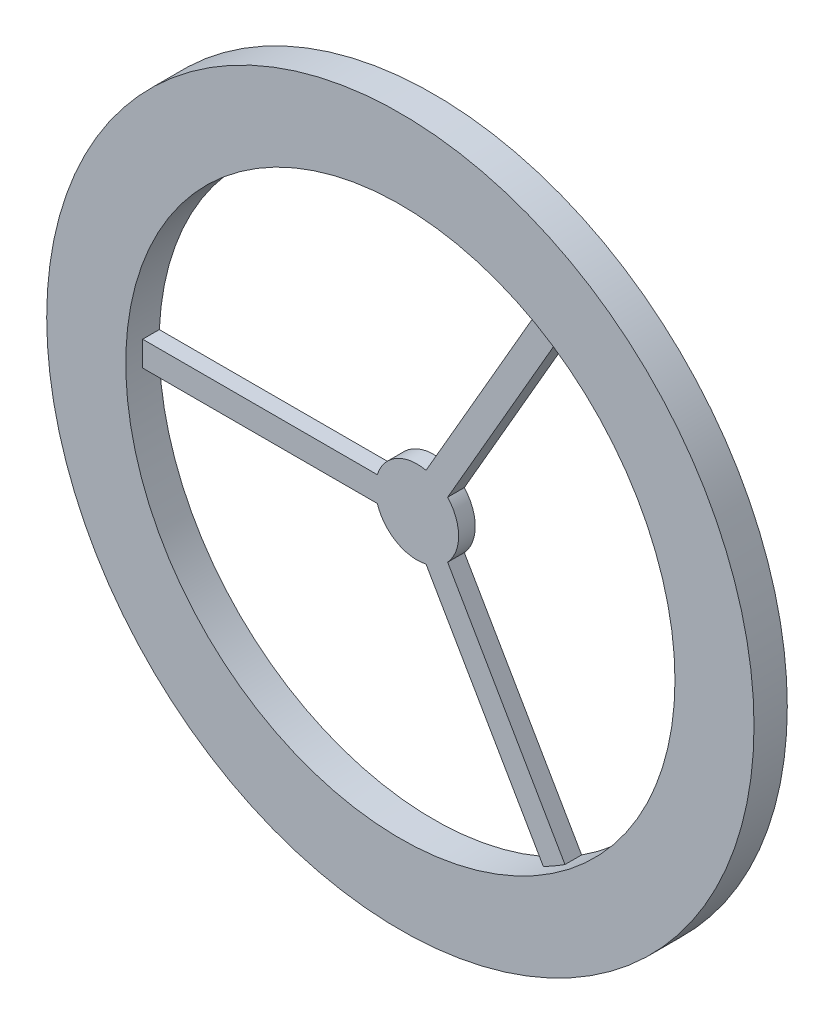
ISO-10303-21;
HEADER;
FILE_DESCRIPTION(('STEP AP214'),'2;1');
FILE_NAME('part.step','',(''),(''),'','','');
FILE_SCHEMA(('AUTOMOTIVE_DESIGN { 1 0 10303 214 1 1 1 1 }'));
ENDSEC;
DATA;
#1=APPLICATION_CONTEXT('core data for automotive mechanical design processes');
#2=APPLICATION_PROTOCOL_DEFINITION('international standard','automotive_design',2000,#1);
#3=PRODUCT_CONTEXT('',#1,'mechanical');
#4=PRODUCT('Part','Part','',(#3));
#5=PRODUCT_RELATED_PRODUCT_CATEGORY('part','',(#4));
#6=PRODUCT_DEFINITION_FORMATION('','',#4);
#7=PRODUCT_DEFINITION_CONTEXT('part definition',#1,'design');
#8=PRODUCT_DEFINITION('design','',#6,#7);
#9=PRODUCT_DEFINITION_SHAPE('','',#8);
#10=(LENGTH_UNIT() NAMED_UNIT(*) SI_UNIT(.MILLI.,.METRE.));
#11=(NAMED_UNIT(*) PLANE_ANGLE_UNIT() SI_UNIT($,.RADIAN.));
#12=(NAMED_UNIT(*) SI_UNIT($,.STERADIAN.) SOLID_ANGLE_UNIT());
#13=UNCERTAINTY_MEASURE_WITH_UNIT(LENGTH_MEASURE(1.E-05),#10,'distance_accuracy_value','');
#14=(GEOMETRIC_REPRESENTATION_CONTEXT(3) GLOBAL_UNCERTAINTY_ASSIGNED_CONTEXT((#13)) GLOBAL_UNIT_ASSIGNED_CONTEXT((#10,
#11,#12)) REPRESENTATION_CONTEXT('',''));
#15=CARTESIAN_POINT('',(0.,0.,0.));
#16=DIRECTION('',(0.,0.,1.));
#17=DIRECTION('',(1.,0.,0.));
#18=AXIS2_PLACEMENT_3D('',#15,#16,#17);
#19=CARTESIAN_POINT('',(-1.29903810567666,-0.749999999999988,-37.6279860581819));
#20=DIRECTION('',(-0.866025403784443,-0.499999999999992,0.));
#21=DIRECTION('',(0.499999999999992,-0.866025403784443,0.));
#22=AXIS2_PLACEMENT_3D('',#19,#20,#21);
#23=PLANE('',#22);
#24=DIRECTION('',(0.,0.,1.));
#25=VECTOR('',#24,1.);
#26=CARTESIAN_POINT('',(15.1839076262,-29.2992994660116,0.));
#27=LINE('',#26,#25);
#28=CARTESIAN_POINT('',(15.1839076262,-29.2992994660116,2.));
#29=VERTEX_POINT('',#28);
#30=CARTESIAN_POINT('',(15.1839076262,-29.2992994660116,0.));
#31=VERTEX_POINT('',#30);
#32=EDGE_CURVE('E241',#29,#31,#27,.F.);
#33=ORIENTED_EDGE('',*,*,#32,.F.);
#34=DIRECTION('',(-0.499999999999992,0.866025403784443,0.));
#35=VECTOR('',#34,1.);
#36=CARTESIAN_POINT('',(-1.29903810567666,-0.749999999999988,2.));
#37=LINE('',#36,#35);
#38=CARTESIAN_POINT('',(1.08580989786566,-4.88067791046459,2.));
#39=VERTEX_POINT('',#38);
#40=EDGE_CURVE('E272',#29,#39,#37,.T.);
#41=ORIENTED_EDGE('',*,*,#40,.T.);
#42=DIRECTION('',(0.,0.,1.));
#43=VECTOR('',#42,1.);
#44=CARTESIAN_POINT('',(1.08580989786566,-4.88067791046459,0.));
#45=LINE('',#44,#43);
#46=CARTESIAN_POINT('',(1.08580989786566,-4.88067791046459,0.));
#47=VERTEX_POINT('',#46);
#48=EDGE_CURVE('E285',#47,#39,#45,.T.);
#49=ORIENTED_EDGE('',*,*,#48,.F.);
#50=DIRECTION('',(-0.499999999999992,0.866025403784443,0.));
#51=VECTOR('',#50,1.);
#52=CARTESIAN_POINT('',(-1.29903810567666,-0.749999999999988,0.));
#53=LINE('',#52,#51);
#54=EDGE_CURVE('E265',#31,#47,#53,.T.);
#55=ORIENTED_EDGE('',*,*,#54,.F.);
#56=EDGE_LOOP('',(#33,#41,#49,#55));
#57=FACE_BOUND('',#56,.T.);
#58=ADVANCED_FACE('F119',(#57),#23,.T.);
#59=CARTESIAN_POINT('',(1.29903810567667,0.749999999999988,-37.6279860581819));
#60=DIRECTION('',(-0.866025403784443,-0.499999999999992,0.));
#61=DIRECTION('',(0.499999999999992,-0.866025403784443,0.));
#62=AXIS2_PLACEMENT_3D('',#59,#60,#61);
#63=PLANE('',#62);
#64=DIRECTION('',(-0.499999999999992,0.866025403784443,0.));
#65=VECTOR('',#64,1.);
#66=CARTESIAN_POINT('',(1.29903810567667,0.749999999999988,2.));
#67=LINE('',#66,#65);
#68=CARTESIAN_POINT('',(17.7819838375533,-27.7992994660116,2.));
#69=VERTEX_POINT('',#68);
#70=CARTESIAN_POINT('',(3.68388610921899,-3.38067791046461,2.));
#71=VERTEX_POINT('',#70);
#72=EDGE_CURVE('E134',#69,#71,#67,.T.);
#73=ORIENTED_EDGE('',*,*,#72,.F.);
#74=DIRECTION('',(0.,0.,1.));
#75=VECTOR('',#74,1.);
#76=CARTESIAN_POINT('',(17.7819838375533,-27.7992994660116,0.));
#77=LINE('',#76,#75);
#78=CARTESIAN_POINT('',(17.7819838375533,-27.7992994660116,0.));
#79=VERTEX_POINT('',#78);
#80=EDGE_CURVE('E234',#69,#79,#77,.F.);
#81=ORIENTED_EDGE('',*,*,#80,.T.);
#82=DIRECTION('',(-0.499999999999992,0.866025403784443,0.));
#83=VECTOR('',#82,1.);
#84=CARTESIAN_POINT('',(1.29903810567667,0.749999999999988,0.));
#85=LINE('',#84,#83);
#86=CARTESIAN_POINT('',(3.68388610921899,-3.38067791046461,0.));
#87=VERTEX_POINT('',#86);
#88=EDGE_CURVE('E141',#79,#87,#85,.T.);
#89=ORIENTED_EDGE('',*,*,#88,.T.);
#90=DIRECTION('',(0.,0.,1.));
#91=VECTOR('',#90,1.);
#92=CARTESIAN_POINT('',(3.68388610921899,-3.38067791046461,0.));
#93=LINE('',#92,#91);
#94=EDGE_CURVE('E283',#87,#71,#93,.T.);
#95=ORIENTED_EDGE('',*,*,#94,.T.);
#96=EDGE_LOOP('',(#73,#81,#89,#95));
#97=FACE_BOUND('',#96,.T.);
#98=ADVANCED_FACE('F337',(#97),#63,.F.);
#99=CARTESIAN_POINT('',(-1.29903810567665,0.750000000000006,-37.6279860581819));
#100=DIRECTION('',(0.866025403784436,-0.500000000000004,0.));
#101=DIRECTION('',(0.500000000000004,0.866025403784436,0.));
#102=AXIS2_PLACEMENT_3D('',#99,#100,#101);
#103=PLANE('',#102);
#104=DIRECTION('',(-0.500000000000004,-0.866025403784436,0.));
#105=VECTOR('',#104,1.);
#106=CARTESIAN_POINT('',(-1.29903810567665,0.750000000000006,2.));
#107=LINE('',#106,#105);
#108=CARTESIAN_POINT('',(15.1839076262004,29.2992994660114,2.));
#109=VERTEX_POINT('',#108);
#110=CARTESIAN_POINT('',(1.08580989786573,4.88067791046457,2.));
#111=VERTEX_POINT('',#110);
#112=EDGE_CURVE('E328',#109,#111,#107,.T.);
#113=ORIENTED_EDGE('',*,*,#112,.F.);
#114=DIRECTION('',(0.,0.,1.));
#115=VECTOR('',#114,1.);
#116=CARTESIAN_POINT('',(15.1839076262004,29.2992994660113,0.));
#117=LINE('',#116,#115);
#118=CARTESIAN_POINT('',(15.1839076262004,29.2992994660114,0.));
#119=VERTEX_POINT('',#118);
#120=EDGE_CURVE('E224',#109,#119,#117,.F.);
#121=ORIENTED_EDGE('',*,*,#120,.T.);
#122=DIRECTION('',(-0.500000000000004,-0.866025403784436,0.));
#123=VECTOR('',#122,1.);
#124=CARTESIAN_POINT('',(-1.29903810567665,0.750000000000006,0.));
#125=LINE('',#124,#123);
#126=CARTESIAN_POINT('',(1.08580989786573,4.88067791046457,0.));
#127=VERTEX_POINT('',#126);
#128=EDGE_CURVE('E287',#119,#127,#125,.T.);
#129=ORIENTED_EDGE('',*,*,#128,.T.);
#130=DIRECTION('',(0.,0.,1.));
#131=VECTOR('',#130,1.);
#132=CARTESIAN_POINT('',(1.08580989786573,4.88067791046457,0.));
#133=LINE('',#132,#131);
#134=EDGE_CURVE('E280',#127,#111,#133,.T.);
#135=ORIENTED_EDGE('',*,*,#134,.T.);
#136=EDGE_LOOP('',(#113,#121,#129,#135));
#137=FACE_BOUND('',#136,.T.);
#138=ADVANCED_FACE('F327',(#137),#103,.F.);
#139=CARTESIAN_POINT('',(1.29903810567665,-0.750000000000006,-37.6279860581819));
#140=DIRECTION('',(0.866025403784436,-0.500000000000004,0.));
#141=DIRECTION('',(0.500000000000004,0.866025403784436,0.));
#142=AXIS2_PLACEMENT_3D('',#139,#140,#141);
#143=PLANE('',#142);
#144=DIRECTION('',(0.,0.,1.));
#145=VECTOR('',#144,1.);
#146=CARTESIAN_POINT('',(17.7819838375537,27.7992994660113,0.));
#147=LINE('',#146,#145);
#148=CARTESIAN_POINT('',(17.7819838375537,27.7992994660113,2.));
#149=VERTEX_POINT('',#148);
#150=CARTESIAN_POINT('',(17.7819838375537,27.7992994660113,0.));
#151=VERTEX_POINT('',#150);
#152=EDGE_CURVE('E221',#149,#151,#147,.F.);
#153=ORIENTED_EDGE('',*,*,#152,.F.);
#154=DIRECTION('',(-0.500000000000004,-0.866025403784436,0.));
#155=VECTOR('',#154,1.);
#156=CARTESIAN_POINT('',(1.29903810567665,-0.750000000000006,2.));
#157=LINE('',#156,#155);
#158=CARTESIAN_POINT('',(3.68388610921904,3.38067791046456,2.));
#159=VERTEX_POINT('',#158);
#160=EDGE_CURVE('E206',#149,#159,#157,.T.);
#161=ORIENTED_EDGE('',*,*,#160,.T.);
#162=DIRECTION('',(0.,0.,1.));
#163=VECTOR('',#162,1.);
#164=CARTESIAN_POINT('',(3.68388610921904,3.38067791046456,0.));
#165=LINE('',#164,#163);
#166=CARTESIAN_POINT('',(3.68388610921904,3.38067791046456,0.));
#167=VERTEX_POINT('',#166);
#168=EDGE_CURVE('E278',#167,#159,#165,.T.);
#169=ORIENTED_EDGE('',*,*,#168,.F.);
#170=DIRECTION('',(-0.500000000000004,-0.866025403784436,0.));
#171=VECTOR('',#170,1.);
#172=CARTESIAN_POINT('',(1.29903810567665,-0.750000000000006,0.));
#173=LINE('',#172,#171);
#174=EDGE_CURVE('E230',#151,#167,#173,.T.);
#175=ORIENTED_EDGE('',*,*,#174,.F.);
#176=EDGE_LOOP('',(#153,#161,#169,#175));
#177=FACE_BOUND('',#176,.T.);
#178=ADVANCED_FACE('F228',(#177),#143,.T.);
#179=CARTESIAN_POINT('',(0.,1.5,-37.6279860581819));
#180=DIRECTION('',(0.,1.,0.));
#181=DIRECTION('',(-1.,0.,0.));
#182=AXIS2_PLACEMENT_3D('',#179,#180,#181);
#183=PLANE('',#182);
#184=DIRECTION('',(0.,0.,1.));
#185=VECTOR('',#184,1.);
#186=CARTESIAN_POINT('',(-32.9658914637539,1.5,0.));
#187=LINE('',#186,#185);
#188=CARTESIAN_POINT('',(-32.9658914637539,1.5,2.));
#189=VERTEX_POINT('',#188);
#190=CARTESIAN_POINT('',(-32.9658914637539,1.5,0.));
#191=VERTEX_POINT('',#190);
#192=EDGE_CURVE('E232',#189,#191,#187,.F.);
#193=ORIENTED_EDGE('',*,*,#192,.F.);
#194=DIRECTION('',(1.,0.,0.));
#195=VECTOR('',#194,1.);
#196=CARTESIAN_POINT('',(0.,1.5,2.));
#197=LINE('',#196,#195);
#198=CARTESIAN_POINT('',(-4.76969600708473,1.5,2.));
#199=VERTEX_POINT('',#198);
#200=EDGE_CURVE('E320',#189,#199,#197,.T.);
#201=ORIENTED_EDGE('',*,*,#200,.T.);
#202=DIRECTION('',(0.,0.,1.));
#203=VECTOR('',#202,1.);
#204=CARTESIAN_POINT('',(-4.76969600708473,1.5,0.));
#205=LINE('',#204,#203);
#206=CARTESIAN_POINT('',(-4.76969600708473,1.5,0.));
#207=VERTEX_POINT('',#206);
#208=EDGE_CURVE('E270',#207,#199,#205,.T.);
#209=ORIENTED_EDGE('',*,*,#208,.F.);
#210=DIRECTION('',(1.,0.,0.));
#211=VECTOR('',#210,1.);
#212=CARTESIAN_POINT('',(0.,1.5,0.));
#213=LINE('',#212,#211);
#214=EDGE_CURVE('E289',#191,#207,#213,.T.);
#215=ORIENTED_EDGE('',*,*,#214,.F.);
#216=EDGE_LOOP('',(#193,#201,#209,#215));
#217=FACE_BOUND('',#216,.T.);
#218=ADVANCED_FACE('F318',(#217),#183,.T.);
#219=CARTESIAN_POINT('',(0.,-1.5,-37.6279860581819));
#220=DIRECTION('',(0.,1.,0.));
#221=DIRECTION('',(-1.,0.,0.));
#222=AXIS2_PLACEMENT_3D('',#219,#220,#221);
#223=PLANE('',#222);
#224=DIRECTION('',(1.,0.,0.));
#225=VECTOR('',#224,1.);
#226=CARTESIAN_POINT('',(0.,-1.5,2.));
#227=LINE('',#226,#225);
#228=CARTESIAN_POINT('',(-32.9658914637539,-1.5,2.));
#229=VERTEX_POINT('',#228);
#230=CARTESIAN_POINT('',(-4.76969600708473,-1.5,2.));
#231=VERTEX_POINT('',#230);
#232=EDGE_CURVE('E247',#229,#231,#227,.T.);
#233=ORIENTED_EDGE('',*,*,#232,.F.);
#234=DIRECTION('',(0.,0.,1.));
#235=VECTOR('',#234,1.);
#236=CARTESIAN_POINT('',(-32.9658914637539,-1.5,0.));
#237=LINE('',#236,#235);
#238=CARTESIAN_POINT('',(-32.9658914637539,-1.5,0.));
#239=VERTEX_POINT('',#238);
#240=EDGE_CURVE('E236',#229,#239,#237,.F.);
#241=ORIENTED_EDGE('',*,*,#240,.T.);
#242=DIRECTION('',(1.,0.,0.));
#243=VECTOR('',#242,1.);
#244=CARTESIAN_POINT('',(0.,-1.5,0.));
#245=LINE('',#244,#243);
#246=CARTESIAN_POINT('',(-4.76969600708473,-1.5,0.));
#247=VERTEX_POINT('',#246);
#248=EDGE_CURVE('E250',#239,#247,#245,.T.);
#249=ORIENTED_EDGE('',*,*,#248,.T.);
#250=DIRECTION('',(0.,0.,1.));
#251=VECTOR('',#250,1.);
#252=CARTESIAN_POINT('',(-4.76969600708473,-1.5,0.));
#253=LINE('',#252,#251);
#254=EDGE_CURVE('E127',#247,#231,#253,.T.);
#255=ORIENTED_EDGE('',*,*,#254,.T.);
#256=EDGE_LOOP('',(#233,#241,#249,#255));
#257=FACE_BOUND('',#256,.T.);
#258=ADVANCED_FACE('F246',(#257),#223,.F.);
#259=CARTESIAN_POINT('',(0.,0.,0.));
#260=DIRECTION('',(0.,0.,1.));
#261=DIRECTION('',(1.,0.,0.));
#262=AXIS2_PLACEMENT_3D('',#259,#260,#261);
#263=CYLINDRICAL_SURFACE('',#262,5.);
#264=ORIENTED_EDGE('',*,*,#48,.T.);
#265=CARTESIAN_POINT('',(0.,0.,2.));
#266=DIRECTION('',(0.,0.,1.));
#267=DIRECTION('',(1.,0.,0.));
#268=AXIS2_PLACEMENT_3D('',#265,#266,#267);
#269=CIRCLE('',#268,5.);
#270=EDGE_CURVE('E258',#39,#231,#269,.F.);
#271=ORIENTED_EDGE('',*,*,#270,.T.);
#272=ORIENTED_EDGE('',*,*,#254,.F.);
#273=CARTESIAN_POINT('',(0.,0.,0.));
#274=DIRECTION('',(0.,0.,1.));
#275=DIRECTION('',(1.,0.,0.));
#276=AXIS2_PLACEMENT_3D('',#273,#274,#275);
#277=CIRCLE('',#276,5.);
#278=EDGE_CURVE('E256',#247,#47,#277,.T.);
#279=ORIENTED_EDGE('',*,*,#278,.T.);
#280=EDGE_LOOP('',(#264,#271,#272,#279));
#281=FACE_BOUND('',#280,.T.);
#282=ADVANCED_FACE('F255',(#281),#263,.T.);
#283=ORIENTED_EDGE('',*,*,#208,.T.);
#284=CARTESIAN_POINT('',(0.,0.,2.));
#285=DIRECTION('',(0.,0.,1.));
#286=DIRECTION('',(1.,0.,0.));
#287=AXIS2_PLACEMENT_3D('',#284,#285,#286);
#288=CIRCLE('',#287,5.);
#289=EDGE_CURVE('E325',#199,#111,#288,.F.);
#290=ORIENTED_EDGE('',*,*,#289,.T.);
#291=ORIENTED_EDGE('',*,*,#134,.F.);
#292=EDGE_CURVE('E266',#127,#207,#277,.T.);
#293=ORIENTED_EDGE('',*,*,#292,.T.);
#294=EDGE_LOOP('',(#283,#290,#291,#293));
#295=FACE_BOUND('',#294,.T.);
#296=ADVANCED_FACE('F323',(#295),#263,.T.);
#297=ORIENTED_EDGE('',*,*,#168,.T.);
#298=CARTESIAN_POINT('',(0.,0.,2.));
#299=DIRECTION('',(0.,0.,1.));
#300=DIRECTION('',(1.,0.,0.));
#301=AXIS2_PLACEMENT_3D('',#298,#299,#300);
#302=CIRCLE('',#301,5.);
#303=EDGE_CURVE('E12',#159,#71,#302,.F.);
#304=ORIENTED_EDGE('',*,*,#303,.T.);
#305=ORIENTED_EDGE('',*,*,#94,.F.);
#306=EDGE_CURVE('E267',#87,#167,#277,.T.);
#307=ORIENTED_EDGE('',*,*,#306,.T.);
#308=EDGE_LOOP('',(#297,#304,#305,#307));
#309=FACE_BOUND('',#308,.T.);
#310=ADVANCED_FACE('F340',(#309),#263,.T.);
#311=CARTESIAN_POINT('',(0.,0.,4.));
#312=DIRECTION('',(0.,0.,1.));
#313=DIRECTION('',(1.,0.,0.));
#314=AXIS2_PLACEMENT_3D('',#311,#312,#313);
#315=PLANE('',#314);
#316=CARTESIAN_POINT('',(0.,0.,4.));
#317=DIRECTION('',(0.,0.,1.));
#318=DIRECTION('',(1.,0.,0.));
#319=AXIS2_PLACEMENT_3D('',#316,#317,#318);
#320=CIRCLE('',#319,33.);
#321=CARTESIAN_POINT('',(33.,0.,4.));
#322=VERTEX_POINT('',#321);
#323=EDGE_CURVE('E291',#322,#322,#320,.T.);
#324=ORIENTED_EDGE('',*,*,#323,.F.);
#325=EDGE_LOOP('',(#324));
#326=FACE_BOUND('',#325,.T.);
#327=CARTESIAN_POINT('',(0.,0.,4.));
#328=DIRECTION('',(0.,0.,1.));
#329=DIRECTION('',(1.,0.,0.));
#330=AXIS2_PLACEMENT_3D('',#327,#328,#329);
#331=CIRCLE('',#330,42.5);
#332=CARTESIAN_POINT('',(42.5,0.,4.));
#333=VERTEX_POINT('',#332);
#334=EDGE_CURVE('E303',#333,#333,#331,.T.);
#335=ORIENTED_EDGE('',*,*,#334,.T.);
#336=EDGE_LOOP('',(#335));
#337=FACE_BOUND('',#336,.T.);
#338=ADVANCED_FACE('F346',(#326,#337),#315,.T.);
#339=CARTESIAN_POINT('',(0.,0.,4.));
#340=DIRECTION('',(0.,0.,-1.));
#341=DIRECTION('',(-1.,0.,0.));
#342=AXIS2_PLACEMENT_3D('',#339,#340,#341);
#343=CYLINDRICAL_SURFACE('',#342,42.5);
#344=ORIENTED_EDGE('',*,*,#334,.F.);
#345=EDGE_LOOP('',(#344));
#346=FACE_BOUND('',#345,.T.);
#347=CARTESIAN_POINT('',(0.,0.,0.));
#348=DIRECTION('',(0.,0.,1.));
#349=DIRECTION('',(1.,0.,0.));
#350=AXIS2_PLACEMENT_3D('',#347,#348,#349);
#351=CIRCLE('',#350,42.5);
#352=CARTESIAN_POINT('',(42.5,0.,0.));
#353=VERTEX_POINT('',#352);
#354=EDGE_CURVE('E306',#353,#353,#351,.T.);
#355=ORIENTED_EDGE('',*,*,#354,.T.);
#356=EDGE_LOOP('',(#355));
#357=FACE_BOUND('',#356,.T.);
#358=ADVANCED_FACE('F121',(#346,#357),#343,.T.);
#359=CARTESIAN_POINT('',(0.,0.,0.));
#360=DIRECTION('',(0.,0.,1.));
#361=DIRECTION('',(1.,0.,0.));
#362=AXIS2_PLACEMENT_3D('',#359,#360,#361);
#363=PLANE('',#362);
#364=ORIENTED_EDGE('',*,*,#292,.F.);
#365=ORIENTED_EDGE('',*,*,#128,.F.);
#366=CARTESIAN_POINT('',(0.,0.,0.));
#367=DIRECTION('',(0.,0.,1.));
#368=DIRECTION('',(1.,0.,0.));
#369=AXIS2_PLACEMENT_3D('',#366,#367,#368);
#370=CIRCLE('',#369,33.);
#371=EDGE_CURVE('E300',#119,#191,#370,.T.);
#372=ORIENTED_EDGE('',*,*,#371,.T.);
#373=ORIENTED_EDGE('',*,*,#214,.T.);
#374=EDGE_LOOP('',(#364,#365,#372,#373));
#375=FACE_BOUND('',#374,.T.);
#376=ORIENTED_EDGE('',*,*,#278,.F.);
#377=ORIENTED_EDGE('',*,*,#248,.F.);
#378=EDGE_CURVE('E299',#239,#31,#370,.T.);
#379=ORIENTED_EDGE('',*,*,#378,.T.);
#380=ORIENTED_EDGE('',*,*,#54,.T.);
#381=EDGE_LOOP('',(#376,#377,#379,#380));
#382=FACE_BOUND('',#381,.T.);
#383=ORIENTED_EDGE('',*,*,#174,.T.);
#384=ORIENTED_EDGE('',*,*,#306,.F.);
#385=ORIENTED_EDGE('',*,*,#88,.F.);
#386=EDGE_CURVE('E297',#79,#151,#370,.T.);
#387=ORIENTED_EDGE('',*,*,#386,.T.);
#388=EDGE_LOOP('',(#383,#384,#385,#387));
#389=FACE_BOUND('',#388,.T.);
#390=ORIENTED_EDGE('',*,*,#354,.F.);
#391=EDGE_LOOP('',(#390));
#392=FACE_BOUND('',#391,.T.);
#393=ADVANCED_FACE('F261',(#375,#382,#389,#392),#363,.F.);
#394=CARTESIAN_POINT('',(0.,0.,0.));
#395=DIRECTION('',(0.,0.,1.));
#396=DIRECTION('',(1.,0.,0.));
#397=AXIS2_PLACEMENT_3D('',#394,#395,#396);
#398=CYLINDRICAL_SURFACE('',#397,33.);
#399=CARTESIAN_POINT('',(0.,0.,2.));
#400=DIRECTION('',(0.,0.,1.));
#401=DIRECTION('',(1.,0.,0.));
#402=AXIS2_PLACEMENT_3D('',#399,#400,#401);
#403=CIRCLE('',#402,33.);
#404=EDGE_CURVE('E227',#29,#69,#403,.T.);
#405=ORIENTED_EDGE('',*,*,#404,.F.);
#406=ORIENTED_EDGE('',*,*,#32,.T.);
#407=ORIENTED_EDGE('',*,*,#378,.F.);
#408=ORIENTED_EDGE('',*,*,#240,.F.);
#409=EDGE_CURVE('E225',#189,#229,#403,.T.);
#410=ORIENTED_EDGE('',*,*,#409,.F.);
#411=ORIENTED_EDGE('',*,*,#192,.T.);
#412=ORIENTED_EDGE('',*,*,#371,.F.);
#413=ORIENTED_EDGE('',*,*,#120,.F.);
#414=EDGE_CURVE('E209',#149,#109,#403,.T.);
#415=ORIENTED_EDGE('',*,*,#414,.F.);
#416=ORIENTED_EDGE('',*,*,#152,.T.);
#417=ORIENTED_EDGE('',*,*,#386,.F.);
#418=ORIENTED_EDGE('',*,*,#80,.F.);
#419=EDGE_LOOP('',(#405,#406,#407,#408,#410,#411,#412,#413,#415,#416,#417,#418));
#420=FACE_BOUND('',#419,.T.);
#421=ORIENTED_EDGE('',*,*,#323,.T.);
#422=EDGE_LOOP('',(#421));
#423=FACE_BOUND('',#422,.T.);
#424=ADVANCED_FACE('F218',(#420,#423),#398,.F.);
#425=CARTESIAN_POINT('',(0.,0.,2.));
#426=DIRECTION('',(0.,0.,1.));
#427=DIRECTION('',(1.,0.,0.));
#428=AXIS2_PLACEMENT_3D('',#425,#426,#427);
#429=PLANE('',#428);
#430=ORIENTED_EDGE('',*,*,#404,.T.);
#431=ORIENTED_EDGE('',*,*,#72,.T.);
#432=ORIENTED_EDGE('',*,*,#303,.F.);
#433=ORIENTED_EDGE('',*,*,#160,.F.);
#434=ORIENTED_EDGE('',*,*,#414,.T.);
#435=ORIENTED_EDGE('',*,*,#112,.T.);
#436=ORIENTED_EDGE('',*,*,#289,.F.);
#437=ORIENTED_EDGE('',*,*,#200,.F.);
#438=ORIENTED_EDGE('',*,*,#409,.T.);
#439=ORIENTED_EDGE('',*,*,#232,.T.);
#440=ORIENTED_EDGE('',*,*,#270,.F.);
#441=ORIENTED_EDGE('',*,*,#40,.F.);
#442=EDGE_LOOP('',(#430,#431,#432,#433,#434,#435,#436,#437,#438,#439,#440,#441));
#443=FACE_BOUND('',#442,.T.);
#444=ADVANCED_FACE('F208',(#443),#429,.T.);
#445=CLOSED_SHELL('',(#58,#98,#138,#178,#218,#258,#282,#296,#310,#338,#358,#393,#424,#444));
#446=MANIFOLD_SOLID_BREP('B2',#445);
#447=ADVANCED_BREP_SHAPE_REPRESENTATION('',(#18,#446),#14);
#448=SHAPE_DEFINITION_REPRESENTATION(#9,#447);
ENDSEC;
END-ISO-10303-21;
